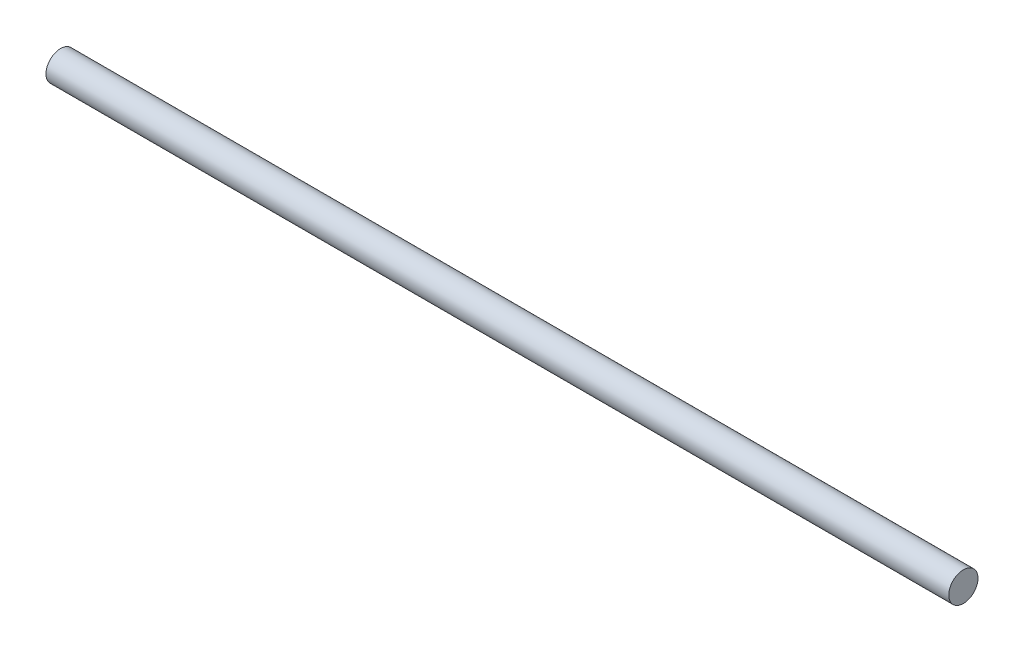
ISO-10303-21;
HEADER;
FILE_DESCRIPTION(('STEP AP214'),'2;1');
FILE_NAME('part.step','',(''),(''),'','','');
FILE_SCHEMA(('AUTOMOTIVE_DESIGN { 1 0 10303 214 1 1 1 1 }'));
ENDSEC;
DATA;
#1=APPLICATION_CONTEXT('core data for automotive mechanical design processes');
#2=APPLICATION_PROTOCOL_DEFINITION('international standard','automotive_design',2000,#1);
#3=PRODUCT_CONTEXT('',#1,'mechanical');
#4=PRODUCT('Part','Part','',(#3));
#5=PRODUCT_RELATED_PRODUCT_CATEGORY('part','',(#4));
#6=PRODUCT_DEFINITION_FORMATION('','',#4);
#7=PRODUCT_DEFINITION_CONTEXT('part definition',#1,'design');
#8=PRODUCT_DEFINITION('design','',#6,#7);
#9=PRODUCT_DEFINITION_SHAPE('','',#8);
#10=(LENGTH_UNIT() NAMED_UNIT(*) SI_UNIT(.MILLI.,.METRE.));
#11=(NAMED_UNIT(*) PLANE_ANGLE_UNIT() SI_UNIT($,.RADIAN.));
#12=(NAMED_UNIT(*) SI_UNIT($,.STERADIAN.) SOLID_ANGLE_UNIT());
#13=UNCERTAINTY_MEASURE_WITH_UNIT(LENGTH_MEASURE(1.E-05),#10,'distance_accuracy_value','');
#14=(GEOMETRIC_REPRESENTATION_CONTEXT(3) GLOBAL_UNCERTAINTY_ASSIGNED_CONTEXT((#13)) GLOBAL_UNIT_ASSIGNED_CONTEXT((#10,
#11,#12)) REPRESENTATION_CONTEXT('',''));
#15=CARTESIAN_POINT('',(0.,0.,0.));
#16=DIRECTION('',(0.,0.,1.));
#17=DIRECTION('',(1.,0.,0.));
#18=AXIS2_PLACEMENT_3D('',#15,#16,#17);
#19=CARTESIAN_POINT('',(71.,0.,0.));
#20=DIRECTION('',(-1.,0.,0.));
#21=DIRECTION('',(0.,0.,1.));
#22=AXIS2_PLACEMENT_3D('',#19,#20,#21);
#23=CYLINDRICAL_SURFACE('',#22,1.15);
#24=CARTESIAN_POINT('',(71.,0.,0.));
#25=DIRECTION('',(1.,0.,0.));
#26=DIRECTION('',(0.,0.,-1.));
#27=AXIS2_PLACEMENT_3D('',#24,#25,#26);
#28=CIRCLE('',#27,1.15);
#29=CARTESIAN_POINT('',(71.,0.,-1.15));
#30=VERTEX_POINT('',#29);
#31=EDGE_CURVE('E10',#30,#30,#28,.T.);
#32=ORIENTED_EDGE('',*,*,#31,.F.);
#33=EDGE_LOOP('',(#32));
#34=FACE_BOUND('',#33,.T.);
#35=CARTESIAN_POINT('',(0.,0.,0.));
#36=DIRECTION('',(1.,0.,0.));
#37=DIRECTION('',(0.,0.,-1.));
#38=AXIS2_PLACEMENT_3D('',#35,#36,#37);
#39=CIRCLE('',#38,1.15);
#40=CARTESIAN_POINT('',(0.,0.,-1.15));
#41=VERTEX_POINT('',#40);
#42=EDGE_CURVE('E34',#41,#41,#39,.T.);
#43=ORIENTED_EDGE('',*,*,#42,.T.);
#44=EDGE_LOOP('',(#43));
#45=FACE_BOUND('',#44,.T.);
#46=ADVANCED_FACE('F31',(#34,#45),#23,.T.);
#47=CARTESIAN_POINT('',(71.,0.,0.));
#48=DIRECTION('',(1.,0.,0.));
#49=DIRECTION('',(0.,0.,-1.));
#50=AXIS2_PLACEMENT_3D('',#47,#48,#49);
#51=PLANE('',#50);
#52=ORIENTED_EDGE('',*,*,#31,.T.);
#53=EDGE_LOOP('',(#52));
#54=FACE_BOUND('',#53,.T.);
#55=ADVANCED_FACE('F46',(#54),#51,.T.);
#56=CARTESIAN_POINT('',(0.,0.,0.));
#57=DIRECTION('',(1.,0.,0.));
#58=DIRECTION('',(0.,0.,-1.));
#59=AXIS2_PLACEMENT_3D('',#56,#57,#58);
#60=PLANE('',#59);
#61=ORIENTED_EDGE('',*,*,#42,.F.);
#62=EDGE_LOOP('',(#61));
#63=FACE_BOUND('',#62,.T.);
#64=ADVANCED_FACE('F44',(#63),#60,.F.);
#65=CLOSED_SHELL('',(#46,#55,#64));
#66=MANIFOLD_SOLID_BREP('B2',#65);
#67=ADVANCED_BREP_SHAPE_REPRESENTATION('',(#18,#66),#14);
#68=SHAPE_DEFINITION_REPRESENTATION(#9,#67);
ENDSEC;
END-ISO-10303-21;
